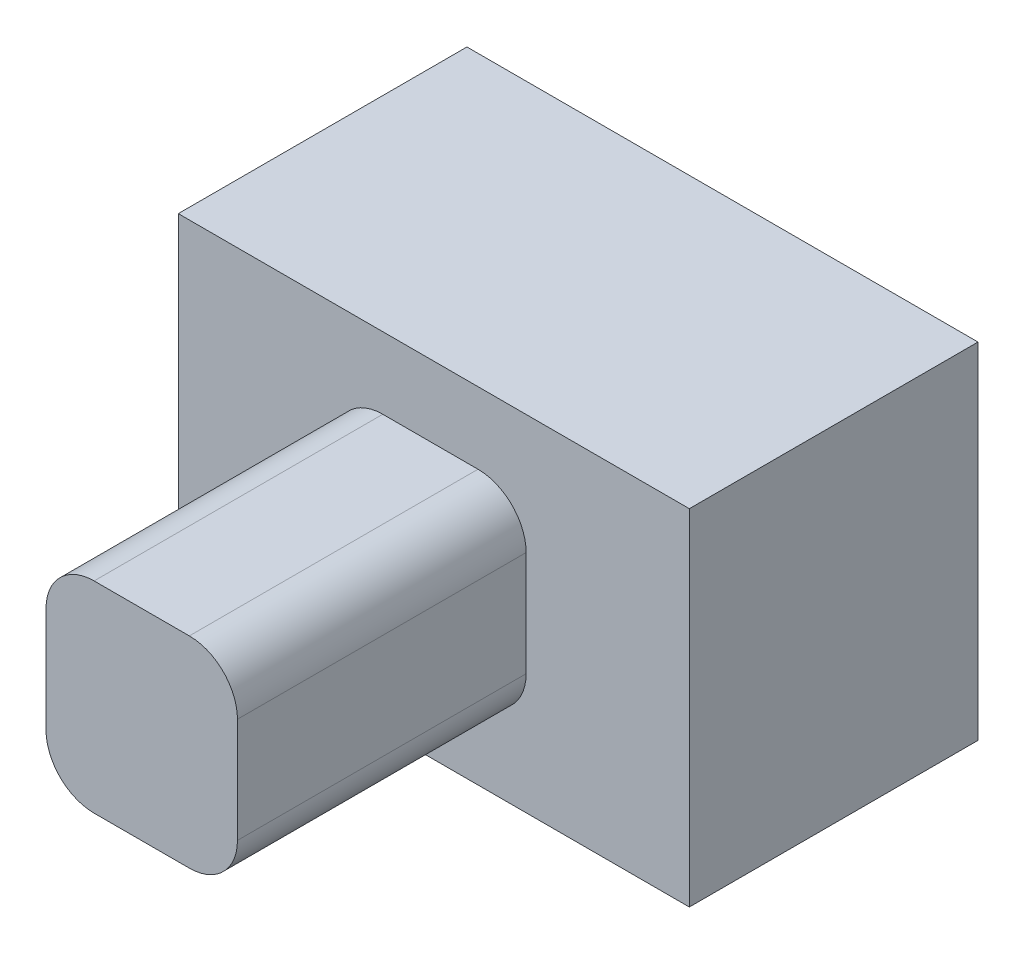
ISO-10303-21;
HEADER;
FILE_DESCRIPTION(('STEP AP214'),'2;1');
FILE_NAME('part.step','',(''),(''),'','','');
FILE_SCHEMA(('AUTOMOTIVE_DESIGN { 1 0 10303 214 1 1 1 1 }'));
ENDSEC;
DATA;
#1=APPLICATION_CONTEXT('core data for automotive mechanical design processes');
#2=APPLICATION_PROTOCOL_DEFINITION('international standard','automotive_design',2000,#1);
#3=PRODUCT_CONTEXT('',#1,'mechanical');
#4=PRODUCT('Part','Part','',(#3));
#5=PRODUCT_RELATED_PRODUCT_CATEGORY('part','',(#4));
#6=PRODUCT_DEFINITION_FORMATION('','',#4);
#7=PRODUCT_DEFINITION_CONTEXT('part definition',#1,'design');
#8=PRODUCT_DEFINITION('design','',#6,#7);
#9=PRODUCT_DEFINITION_SHAPE('','',#8);
#10=(LENGTH_UNIT() NAMED_UNIT(*) SI_UNIT(.MILLI.,.METRE.));
#11=(NAMED_UNIT(*) PLANE_ANGLE_UNIT() SI_UNIT($,.RADIAN.));
#12=(NAMED_UNIT(*) SI_UNIT($,.STERADIAN.) SOLID_ANGLE_UNIT());
#13=UNCERTAINTY_MEASURE_WITH_UNIT(LENGTH_MEASURE(1.E-05),#10,'distance_accuracy_value','');
#14=(GEOMETRIC_REPRESENTATION_CONTEXT(3) GLOBAL_UNCERTAINTY_ASSIGNED_CONTEXT((#13)) GLOBAL_UNIT_ASSIGNED_CONTEXT((#10,
#11,#12)) REPRESENTATION_CONTEXT('',''));
#15=CARTESIAN_POINT('',(0.,0.,0.));
#16=DIRECTION('',(0.,0.,1.));
#17=DIRECTION('',(1.,0.,0.));
#18=AXIS2_PLACEMENT_3D('',#15,#16,#17);
#19=CARTESIAN_POINT('',(-2.41990740449457,4.41492844309721,6.));
#20=DIRECTION('',(1.,0.,0.));
#21=DIRECTION('',(0.,0.,-1.));
#22=AXIS2_PLACEMENT_3D('',#19,#20,#21);
#23=PLANE('',#22);
#24=DIRECTION('',(0.,-1.,0.));
#25=VECTOR('',#24,1.);
#26=CARTESIAN_POINT('',(-2.41990740449457,4.41492844309721,0.));
#27=LINE('',#26,#25);
#28=CARTESIAN_POINT('',(-2.41990740449457,4.41492844309721,0.));
#29=VERTEX_POINT('',#28);
#30=CARTESIAN_POINT('',(-2.41990740449457,-2.75613061858981,0.));
#31=VERTEX_POINT('',#30);
#32=EDGE_CURVE('E245',#29,#31,#27,.T.);
#33=ORIENTED_EDGE('',*,*,#32,.T.);
#34=DIRECTION('',(0.,0.,-1.));
#35=VECTOR('',#34,1.);
#36=CARTESIAN_POINT('',(-2.41990740449457,-2.75613061858981,6.));
#37=LINE('',#36,#35);
#38=CARTESIAN_POINT('',(-2.41990740449457,-2.75613061858981,6.));
#39=VERTEX_POINT('',#38);
#40=EDGE_CURVE('E11',#39,#31,#37,.T.);
#41=ORIENTED_EDGE('',*,*,#40,.F.);
#42=DIRECTION('',(0.,-1.,0.));
#43=VECTOR('',#42,1.);
#44=CARTESIAN_POINT('',(-2.41990740449457,4.41492844309721,6.));
#45=LINE('',#44,#43);
#46=CARTESIAN_POINT('',(-2.41990740449457,4.41492844309721,6.));
#47=VERTEX_POINT('',#46);
#48=EDGE_CURVE('E246',#47,#39,#45,.T.);
#49=ORIENTED_EDGE('',*,*,#48,.F.);
#50=DIRECTION('',(0.,0.,-1.));
#51=VECTOR('',#50,1.);
#52=CARTESIAN_POINT('',(-2.41990740449457,4.41492844309721,6.));
#53=LINE('',#52,#51);
#54=EDGE_CURVE('E256',#47,#29,#53,.T.);
#55=ORIENTED_EDGE('',*,*,#54,.T.);
#56=EDGE_LOOP('',(#33,#41,#49,#55));
#57=FACE_BOUND('',#56,.T.);
#58=ADVANCED_FACE('F33',(#57),#23,.F.);
#59=CARTESIAN_POINT('',(-2.41990740449457,-2.75613061858981,6.));
#60=DIRECTION('',(0.,1.,0.));
#61=DIRECTION('',(0.,0.,1.));
#62=AXIS2_PLACEMENT_3D('',#59,#60,#61);
#63=PLANE('',#62);
#64=DIRECTION('',(1.,0.,0.));
#65=VECTOR('',#64,1.);
#66=CARTESIAN_POINT('',(-2.41990740449457,-2.75613061858981,0.));
#67=LINE('',#66,#65);
#68=CARTESIAN_POINT('',(8.20297188967766,-2.75613061858981,0.));
#69=VERTEX_POINT('',#68);
#70=EDGE_CURVE('E259',#31,#69,#67,.T.);
#71=ORIENTED_EDGE('',*,*,#70,.T.);
#72=DIRECTION('',(0.,0.,-1.));
#73=VECTOR('',#72,1.);
#74=CARTESIAN_POINT('',(8.20297188967766,-2.75613061858981,6.));
#75=LINE('',#74,#73);
#76=CARTESIAN_POINT('',(8.20297188967766,-2.75613061858981,6.));
#77=VERTEX_POINT('',#76);
#78=EDGE_CURVE('E40',#77,#69,#75,.T.);
#79=ORIENTED_EDGE('',*,*,#78,.F.);
#80=DIRECTION('',(1.,0.,0.));
#81=VECTOR('',#80,1.);
#82=CARTESIAN_POINT('',(-2.41990740449457,-2.75613061858981,6.));
#83=LINE('',#82,#81);
#84=EDGE_CURVE('E249',#39,#77,#83,.T.);
#85=ORIENTED_EDGE('',*,*,#84,.F.);
#86=ORIENTED_EDGE('',*,*,#40,.T.);
#87=EDGE_LOOP('',(#71,#79,#85,#86));
#88=FACE_BOUND('',#87,.T.);
#89=ADVANCED_FACE('F289',(#88),#63,.F.);
#90=CARTESIAN_POINT('',(8.20297188967766,4.41492844309721,6.));
#91=DIRECTION('',(-1.,0.,0.));
#92=DIRECTION('',(0.,0.,1.));
#93=AXIS2_PLACEMENT_3D('',#90,#91,#92);
#94=PLANE('',#93);
#95=DIRECTION('',(0.,1.,0.));
#96=VECTOR('',#95,1.);
#97=CARTESIAN_POINT('',(8.20297188967766,4.41492844309721,0.));
#98=LINE('',#97,#96);
#99=CARTESIAN_POINT('',(8.20297188967766,4.41492844309721,0.));
#100=VERTEX_POINT('',#99);
#101=EDGE_CURVE('E261',#69,#100,#98,.T.);
#102=ORIENTED_EDGE('',*,*,#101,.T.);
#103=DIRECTION('',(0.,0.,-1.));
#104=VECTOR('',#103,1.);
#105=CARTESIAN_POINT('',(8.20297188967766,4.41492844309721,6.));
#106=LINE('',#105,#104);
#107=CARTESIAN_POINT('',(8.20297188967766,4.41492844309721,6.));
#108=VERTEX_POINT('',#107);
#109=EDGE_CURVE('E266',#108,#100,#106,.T.);
#110=ORIENTED_EDGE('',*,*,#109,.F.);
#111=DIRECTION('',(0.,1.,0.));
#112=VECTOR('',#111,1.);
#113=CARTESIAN_POINT('',(8.20297188967766,4.41492844309721,6.));
#114=LINE('',#113,#112);
#115=EDGE_CURVE('E252',#77,#108,#114,.T.);
#116=ORIENTED_EDGE('',*,*,#115,.F.);
#117=ORIENTED_EDGE('',*,*,#78,.T.);
#118=EDGE_LOOP('',(#102,#110,#116,#117));
#119=FACE_BOUND('',#118,.T.);
#120=ADVANCED_FACE('F273',(#119),#94,.F.);
#121=CARTESIAN_POINT('',(-2.41990740449457,4.41492844309721,6.));
#122=DIRECTION('',(0.,-1.,0.));
#123=DIRECTION('',(0.,0.,-1.));
#124=AXIS2_PLACEMENT_3D('',#121,#122,#123);
#125=PLANE('',#124);
#126=DIRECTION('',(-1.,0.,0.));
#127=VECTOR('',#126,1.);
#128=CARTESIAN_POINT('',(-2.41990740449457,4.41492844309721,0.));
#129=LINE('',#128,#127);
#130=EDGE_CURVE('E250',#100,#29,#129,.T.);
#131=ORIENTED_EDGE('',*,*,#130,.T.);
#132=ORIENTED_EDGE('',*,*,#54,.F.);
#133=DIRECTION('',(-1.,0.,0.));
#134=VECTOR('',#133,1.);
#135=CARTESIAN_POINT('',(-2.41990740449457,4.41492844309721,6.));
#136=LINE('',#135,#134);
#137=EDGE_CURVE('E254',#108,#47,#136,.T.);
#138=ORIENTED_EDGE('',*,*,#137,.F.);
#139=ORIENTED_EDGE('',*,*,#109,.T.);
#140=EDGE_LOOP('',(#131,#132,#138,#139));
#141=FACE_BOUND('',#140,.T.);
#142=ADVANCED_FACE('F282',(#141),#125,.F.);
#143=CARTESIAN_POINT('',(0.,0.,6.));
#144=DIRECTION('',(0.,0.,1.));
#145=DIRECTION('',(1.,0.,0.));
#146=AXIS2_PLACEMENT_3D('',#143,#144,#145);
#147=PLANE('',#146);
#148=CARTESIAN_POINT('',(3.81000054894556,-0.252824236658512,6.));
#149=DIRECTION('',(0.,0.,1.));
#150=DIRECTION('',(1.,0.,0.));
#151=AXIS2_PLACEMENT_3D('',#148,#149,#150);
#152=CIRCLE('',#151,1.);
#153=CARTESIAN_POINT('',(3.81000054894555,-1.25282423665851,6.));
#154=VERTEX_POINT('',#153);
#155=CARTESIAN_POINT('',(4.81000054894556,-0.252824236658505,6.));
#156=VERTEX_POINT('',#155);
#157=EDGE_CURVE('E55',#154,#156,#152,.T.);
#158=ORIENTED_EDGE('',*,*,#157,.F.);
#159=DIRECTION('',(1.,0.,0.));
#160=VECTOR('',#159,1.);
#161=CARTESIAN_POINT('',(1.83046505701709,-1.25282423665851,6.));
#162=LINE('',#161,#160);
#163=CARTESIAN_POINT('',(1.83046505701709,-1.25282423665851,6.));
#164=VERTEX_POINT('',#163);
#165=EDGE_CURVE('E187',#164,#154,#162,.T.);
#166=ORIENTED_EDGE('',*,*,#165,.F.);
#167=CARTESIAN_POINT('',(1.83046505701708,-0.252824236658512,6.));
#168=DIRECTION('',(0.,0.,1.));
#169=DIRECTION('',(1.,0.,0.));
#170=AXIS2_PLACEMENT_3D('',#167,#168,#169);
#171=CIRCLE('',#170,1.);
#172=CARTESIAN_POINT('',(0.830465057017085,-0.252824236658505,6.));
#173=VERTEX_POINT('',#172);
#174=EDGE_CURVE('E218',#173,#164,#171,.T.);
#175=ORIENTED_EDGE('',*,*,#174,.F.);
#176=DIRECTION('',(0.,-1.,0.));
#177=VECTOR('',#176,1.);
#178=CARTESIAN_POINT('',(0.830465057017085,1.92821033289314,6.));
#179=LINE('',#178,#177);
#180=CARTESIAN_POINT('',(0.830465057017085,1.92821033289314,6.));
#181=VERTEX_POINT('',#180);
#182=EDGE_CURVE('E215',#181,#173,#179,.T.);
#183=ORIENTED_EDGE('',*,*,#182,.F.);
#184=CARTESIAN_POINT('',(1.83046505701708,1.92821033289314,6.));
#185=DIRECTION('',(0.,0.,1.));
#186=DIRECTION('',(1.,0.,0.));
#187=AXIS2_PLACEMENT_3D('',#184,#185,#186);
#188=CIRCLE('',#187,1.);
#189=CARTESIAN_POINT('',(1.83046505701709,2.92821033289314,6.));
#190=VERTEX_POINT('',#189);
#191=EDGE_CURVE('E212',#190,#181,#188,.T.);
#192=ORIENTED_EDGE('',*,*,#191,.F.);
#193=DIRECTION('',(-1.,0.,0.));
#194=VECTOR('',#193,1.);
#195=CARTESIAN_POINT('',(1.83046505701709,2.92821033289314,6.));
#196=LINE('',#195,#194);
#197=CARTESIAN_POINT('',(3.81000054894555,2.92821033289314,6.));
#198=VERTEX_POINT('',#197);
#199=EDGE_CURVE('E209',#198,#190,#196,.T.);
#200=ORIENTED_EDGE('',*,*,#199,.F.);
#201=CARTESIAN_POINT('',(3.81000054894556,1.92821033289314,6.));
#202=DIRECTION('',(0.,0.,1.));
#203=DIRECTION('',(-1.,0.,0.));
#204=AXIS2_PLACEMENT_3D('',#201,#202,#203);
#205=CIRCLE('',#204,1.);
#206=CARTESIAN_POINT('',(4.81000054894556,1.92821033289314,6.));
#207=VERTEX_POINT('',#206);
#208=EDGE_CURVE('E206',#207,#198,#205,.T.);
#209=ORIENTED_EDGE('',*,*,#208,.F.);
#210=DIRECTION('',(0.,1.,0.));
#211=VECTOR('',#210,1.);
#212=CARTESIAN_POINT('',(4.81000054894556,1.92821033289314,6.));
#213=LINE('',#212,#211);
#214=EDGE_CURVE('E203',#156,#207,#213,.T.);
#215=ORIENTED_EDGE('',*,*,#214,.F.);
#216=EDGE_LOOP('',(#158,#166,#175,#183,#192,#200,#209,#215));
#217=FACE_BOUND('',#216,.T.);
#218=ORIENTED_EDGE('',*,*,#48,.T.);
#219=ORIENTED_EDGE('',*,*,#84,.T.);
#220=ORIENTED_EDGE('',*,*,#115,.T.);
#221=ORIENTED_EDGE('',*,*,#137,.T.);
#222=EDGE_LOOP('',(#218,#219,#220,#221));
#223=FACE_BOUND('',#222,.T.);
#224=ADVANCED_FACE('F288',(#217,#223),#147,.T.);
#225=CARTESIAN_POINT('',(0.,0.,0.));
#226=DIRECTION('',(0.,0.,1.));
#227=DIRECTION('',(1.,0.,0.));
#228=AXIS2_PLACEMENT_3D('',#225,#226,#227);
#229=PLANE('',#228);
#230=DIRECTION('',(1.,0.,0.));
#231=VECTOR('',#230,1.);
#232=CARTESIAN_POINT('',(1.86943070713204,1.561146251533,0.));
#233=LINE('',#232,#231);
#234=CARTESIAN_POINT('',(1.86943070713204,1.561146251533,0.));
#235=VERTEX_POINT('',#234);
#236=CARTESIAN_POINT('',(3.61943070713204,1.561146251533,0.));
#237=VERTEX_POINT('',#236);
#238=EDGE_CURVE('E174',#235,#237,#233,.T.);
#239=ORIENTED_EDGE('',*,*,#238,.F.);
#240=DIRECTION('',(0.,1.,0.));
#241=VECTOR('',#240,1.);
#242=CARTESIAN_POINT('',(1.86943070713204,-0.188853748467003,0.));
#243=LINE('',#242,#241);
#244=CARTESIAN_POINT('',(1.86943070713204,-0.188853748467003,0.));
#245=VERTEX_POINT('',#244);
#246=EDGE_CURVE('E47',#245,#235,#243,.T.);
#247=ORIENTED_EDGE('',*,*,#246,.F.);
#248=DIRECTION('',(-1.,0.,0.));
#249=VECTOR('',#248,1.);
#250=CARTESIAN_POINT('',(1.86943070713204,-0.188853748467003,0.));
#251=LINE('',#250,#249);
#252=CARTESIAN_POINT('',(3.61943070713204,-0.188853748467003,0.));
#253=VERTEX_POINT('',#252);
#254=EDGE_CURVE('E165',#253,#245,#251,.T.);
#255=ORIENTED_EDGE('',*,*,#254,.F.);
#256=DIRECTION('',(0.,-1.,0.));
#257=VECTOR('',#256,1.);
#258=CARTESIAN_POINT('',(3.61943070713204,-0.188853748467003,0.));
#259=LINE('',#258,#257);
#260=EDGE_CURVE('E168',#237,#253,#259,.T.);
#261=ORIENTED_EDGE('',*,*,#260,.F.);
#262=EDGE_LOOP('',(#239,#247,#255,#261));
#263=FACE_BOUND('',#262,.T.);
#264=ORIENTED_EDGE('',*,*,#32,.F.);
#265=ORIENTED_EDGE('',*,*,#130,.F.);
#266=ORIENTED_EDGE('',*,*,#101,.F.);
#267=ORIENTED_EDGE('',*,*,#70,.F.);
#268=EDGE_LOOP('',(#264,#265,#266,#267));
#269=FACE_BOUND('',#268,.T.);
#270=ADVANCED_FACE('F279',(#263,#269),#229,.F.);
#271=CARTESIAN_POINT('',(3.81000054894556,-0.252824236658512,12.));
#272=DIRECTION('',(0.,0.,-1.));
#273=DIRECTION('',(-1.,0.,0.));
#274=AXIS2_PLACEMENT_3D('',#271,#272,#273);
#275=CYLINDRICAL_SURFACE('',#274,1.);
#276=ORIENTED_EDGE('',*,*,#157,.T.);
#277=DIRECTION('',(0.,0.,-1.));
#278=VECTOR('',#277,1.);
#279=CARTESIAN_POINT('',(4.81000054894556,-0.252824236658505,12.));
#280=LINE('',#279,#278);
#281=CARTESIAN_POINT('',(4.81000054894556,-0.252824236658505,12.));
#282=VERTEX_POINT('',#281);
#283=EDGE_CURVE('E242',#282,#156,#280,.T.);
#284=ORIENTED_EDGE('',*,*,#283,.F.);
#285=CARTESIAN_POINT('',(3.81000054894556,-0.252824236658512,12.));
#286=DIRECTION('',(0.,0.,1.));
#287=DIRECTION('',(1.,0.,0.));
#288=AXIS2_PLACEMENT_3D('',#285,#286,#287);
#289=CIRCLE('',#288,1.);
#290=CARTESIAN_POINT('',(3.81000054894555,-1.25282423665851,12.));
#291=VERTEX_POINT('',#290);
#292=EDGE_CURVE('E183',#291,#282,#289,.T.);
#293=ORIENTED_EDGE('',*,*,#292,.F.);
#294=DIRECTION('',(0.,0.,-1.));
#295=VECTOR('',#294,1.);
#296=CARTESIAN_POINT('',(3.81000054894555,-1.25282423665851,12.));
#297=LINE('',#296,#295);
#298=EDGE_CURVE('E201',#291,#154,#297,.T.);
#299=ORIENTED_EDGE('',*,*,#298,.T.);
#300=EDGE_LOOP('',(#276,#284,#293,#299));
#301=FACE_BOUND('',#300,.T.);
#302=ADVANCED_FACE('F301',(#301),#275,.T.);
#303=CARTESIAN_POINT('',(4.81000054894556,1.92821033289314,12.));
#304=DIRECTION('',(-1.,0.,0.));
#305=DIRECTION('',(0.,0.,1.));
#306=AXIS2_PLACEMENT_3D('',#303,#304,#305);
#307=PLANE('',#306);
#308=ORIENTED_EDGE('',*,*,#214,.T.);
#309=DIRECTION('',(0.,0.,-1.));
#310=VECTOR('',#309,1.);
#311=CARTESIAN_POINT('',(4.81000054894556,1.92821033289314,12.));
#312=LINE('',#311,#310);
#313=CARTESIAN_POINT('',(4.81000054894556,1.92821033289314,12.));
#314=VERTEX_POINT('',#313);
#315=EDGE_CURVE('E239',#314,#207,#312,.T.);
#316=ORIENTED_EDGE('',*,*,#315,.F.);
#317=DIRECTION('',(0.,1.,0.));
#318=VECTOR('',#317,1.);
#319=CARTESIAN_POINT('',(4.81000054894556,1.92821033289314,12.));
#320=LINE('',#319,#318);
#321=EDGE_CURVE('E186',#282,#314,#320,.T.);
#322=ORIENTED_EDGE('',*,*,#321,.F.);
#323=ORIENTED_EDGE('',*,*,#283,.T.);
#324=EDGE_LOOP('',(#308,#316,#322,#323));
#325=FACE_BOUND('',#324,.T.);
#326=ADVANCED_FACE('F307',(#325),#307,.F.);
#327=CARTESIAN_POINT('',(3.81000054894556,1.92821033289314,12.));
#328=DIRECTION('',(0.,0.,-1.));
#329=DIRECTION('',(-1.,0.,0.));
#330=AXIS2_PLACEMENT_3D('',#327,#328,#329);
#331=CYLINDRICAL_SURFACE('',#330,1.);
#332=ORIENTED_EDGE('',*,*,#208,.T.);
#333=DIRECTION('',(0.,0.,-1.));
#334=VECTOR('',#333,1.);
#335=CARTESIAN_POINT('',(3.81000054894555,2.92821033289314,12.));
#336=LINE('',#335,#334);
#337=CARTESIAN_POINT('',(3.81000054894555,2.92821033289314,12.));
#338=VERTEX_POINT('',#337);
#339=EDGE_CURVE('E236',#338,#198,#336,.T.);
#340=ORIENTED_EDGE('',*,*,#339,.F.);
#341=CARTESIAN_POINT('',(3.81000054894556,1.92821033289314,12.));
#342=DIRECTION('',(0.,0.,1.));
#343=DIRECTION('',(-1.,0.,0.));
#344=AXIS2_PLACEMENT_3D('',#341,#342,#343);
#345=CIRCLE('',#344,1.);
#346=EDGE_CURVE('E189',#314,#338,#345,.T.);
#347=ORIENTED_EDGE('',*,*,#346,.F.);
#348=ORIENTED_EDGE('',*,*,#315,.T.);
#349=EDGE_LOOP('',(#332,#340,#347,#348));
#350=FACE_BOUND('',#349,.T.);
#351=ADVANCED_FACE('F311',(#350),#331,.T.);
#352=CARTESIAN_POINT('',(1.83046505701709,2.92821033289314,12.));
#353=DIRECTION('',(0.,-1.,0.));
#354=DIRECTION('',(0.,0.,-1.));
#355=AXIS2_PLACEMENT_3D('',#352,#353,#354);
#356=PLANE('',#355);
#357=ORIENTED_EDGE('',*,*,#199,.T.);
#358=DIRECTION('',(0.,0.,-1.));
#359=VECTOR('',#358,1.);
#360=CARTESIAN_POINT('',(1.83046505701709,2.92821033289314,12.));
#361=LINE('',#360,#359);
#362=CARTESIAN_POINT('',(1.83046505701709,2.92821033289314,12.));
#363=VERTEX_POINT('',#362);
#364=EDGE_CURVE('E233',#363,#190,#361,.T.);
#365=ORIENTED_EDGE('',*,*,#364,.F.);
#366=DIRECTION('',(-1.,0.,0.));
#367=VECTOR('',#366,1.);
#368=CARTESIAN_POINT('',(1.83046505701709,2.92821033289314,12.));
#369=LINE('',#368,#367);
#370=EDGE_CURVE('E191',#338,#363,#369,.T.);
#371=ORIENTED_EDGE('',*,*,#370,.F.);
#372=ORIENTED_EDGE('',*,*,#339,.T.);
#373=EDGE_LOOP('',(#357,#365,#371,#372));
#374=FACE_BOUND('',#373,.T.);
#375=ADVANCED_FACE('F315',(#374),#356,.F.);
#376=CARTESIAN_POINT('',(1.83046505701708,1.92821033289314,12.));
#377=DIRECTION('',(0.,0.,-1.));
#378=DIRECTION('',(-1.,0.,0.));
#379=AXIS2_PLACEMENT_3D('',#376,#377,#378);
#380=CYLINDRICAL_SURFACE('',#379,1.);
#381=ORIENTED_EDGE('',*,*,#191,.T.);
#382=DIRECTION('',(0.,0.,-1.));
#383=VECTOR('',#382,1.);
#384=CARTESIAN_POINT('',(0.830465057017085,1.92821033289314,12.));
#385=LINE('',#384,#383);
#386=CARTESIAN_POINT('',(0.830465057017085,1.92821033289314,12.));
#387=VERTEX_POINT('',#386);
#388=EDGE_CURVE('E230',#387,#181,#385,.T.);
#389=ORIENTED_EDGE('',*,*,#388,.F.);
#390=CARTESIAN_POINT('',(1.83046505701708,1.92821033289314,12.));
#391=DIRECTION('',(0.,0.,1.));
#392=DIRECTION('',(1.,0.,0.));
#393=AXIS2_PLACEMENT_3D('',#390,#391,#392);
#394=CIRCLE('',#393,1.);
#395=EDGE_CURVE('E193',#363,#387,#394,.T.);
#396=ORIENTED_EDGE('',*,*,#395,.F.);
#397=ORIENTED_EDGE('',*,*,#364,.T.);
#398=EDGE_LOOP('',(#381,#389,#396,#397));
#399=FACE_BOUND('',#398,.T.);
#400=ADVANCED_FACE('F319',(#399),#380,.T.);
#401=CARTESIAN_POINT('',(0.830465057017085,1.92821033289314,12.));
#402=DIRECTION('',(1.,0.,0.));
#403=DIRECTION('',(0.,0.,-1.));
#404=AXIS2_PLACEMENT_3D('',#401,#402,#403);
#405=PLANE('',#404);
#406=ORIENTED_EDGE('',*,*,#182,.T.);
#407=DIRECTION('',(0.,0.,-1.));
#408=VECTOR('',#407,1.);
#409=CARTESIAN_POINT('',(0.830465057017085,-0.252824236658505,12.));
#410=LINE('',#409,#408);
#411=CARTESIAN_POINT('',(0.830465057017085,-0.252824236658505,12.));
#412=VERTEX_POINT('',#411);
#413=EDGE_CURVE('E227',#412,#173,#410,.T.);
#414=ORIENTED_EDGE('',*,*,#413,.F.);
#415=DIRECTION('',(0.,-1.,0.));
#416=VECTOR('',#415,1.);
#417=CARTESIAN_POINT('',(0.830465057017085,1.92821033289314,12.));
#418=LINE('',#417,#416);
#419=EDGE_CURVE('E195',#387,#412,#418,.T.);
#420=ORIENTED_EDGE('',*,*,#419,.F.);
#421=ORIENTED_EDGE('',*,*,#388,.T.);
#422=EDGE_LOOP('',(#406,#414,#420,#421));
#423=FACE_BOUND('',#422,.T.);
#424=ADVANCED_FACE('F323',(#423),#405,.F.);
#425=CARTESIAN_POINT('',(1.83046505701708,-0.252824236658512,12.));
#426=DIRECTION('',(0.,0.,-1.));
#427=DIRECTION('',(-1.,0.,0.));
#428=AXIS2_PLACEMENT_3D('',#425,#426,#427);
#429=CYLINDRICAL_SURFACE('',#428,1.);
#430=ORIENTED_EDGE('',*,*,#174,.T.);
#431=DIRECTION('',(0.,0.,-1.));
#432=VECTOR('',#431,1.);
#433=CARTESIAN_POINT('',(1.83046505701709,-1.25282423665851,12.));
#434=LINE('',#433,#432);
#435=CARTESIAN_POINT('',(1.83046505701709,-1.25282423665851,12.));
#436=VERTEX_POINT('',#435);
#437=EDGE_CURVE('E224',#436,#164,#434,.T.);
#438=ORIENTED_EDGE('',*,*,#437,.F.);
#439=CARTESIAN_POINT('',(1.83046505701708,-0.252824236658512,12.));
#440=DIRECTION('',(0.,0.,1.));
#441=DIRECTION('',(1.,0.,0.));
#442=AXIS2_PLACEMENT_3D('',#439,#440,#441);
#443=CIRCLE('',#442,1.);
#444=EDGE_CURVE('E197',#412,#436,#443,.T.);
#445=ORIENTED_EDGE('',*,*,#444,.F.);
#446=ORIENTED_EDGE('',*,*,#413,.T.);
#447=EDGE_LOOP('',(#430,#438,#445,#446));
#448=FACE_BOUND('',#447,.T.);
#449=ADVANCED_FACE('F327',(#448),#429,.T.);
#450=CARTESIAN_POINT('',(1.83046505701709,-1.25282423665851,12.));
#451=DIRECTION('',(0.,1.,0.));
#452=DIRECTION('',(0.,0.,1.));
#453=AXIS2_PLACEMENT_3D('',#450,#451,#452);
#454=PLANE('',#453);
#455=ORIENTED_EDGE('',*,*,#165,.T.);
#456=ORIENTED_EDGE('',*,*,#298,.F.);
#457=DIRECTION('',(1.,0.,0.));
#458=VECTOR('',#457,1.);
#459=CARTESIAN_POINT('',(1.83046505701709,-1.25282423665851,12.));
#460=LINE('',#459,#458);
#461=EDGE_CURVE('E199',#436,#291,#460,.T.);
#462=ORIENTED_EDGE('',*,*,#461,.F.);
#463=ORIENTED_EDGE('',*,*,#437,.T.);
#464=EDGE_LOOP('',(#455,#456,#462,#463));
#465=FACE_BOUND('',#464,.T.);
#466=ADVANCED_FACE('F331',(#465),#454,.F.);
#467=CARTESIAN_POINT('',(3.81000054894556,-0.252824236658512,12.));
#468=DIRECTION('',(0.,0.,1.));
#469=DIRECTION('',(1.,0.,0.));
#470=AXIS2_PLACEMENT_3D('',#467,#468,#469);
#471=PLANE('',#470);
#472=ORIENTED_EDGE('',*,*,#292,.T.);
#473=ORIENTED_EDGE('',*,*,#321,.T.);
#474=ORIENTED_EDGE('',*,*,#346,.T.);
#475=ORIENTED_EDGE('',*,*,#370,.T.);
#476=ORIENTED_EDGE('',*,*,#395,.T.);
#477=ORIENTED_EDGE('',*,*,#419,.T.);
#478=ORIENTED_EDGE('',*,*,#444,.T.);
#479=ORIENTED_EDGE('',*,*,#461,.T.);
#480=EDGE_LOOP('',(#472,#473,#474,#475,#476,#477,#478,#479));
#481=FACE_BOUND('',#480,.T.);
#482=ADVANCED_FACE('F335',(#481),#471,.T.);
#483=CARTESIAN_POINT('',(1.86943070713204,-0.188853748467003,4.));
#484=DIRECTION('',(-1.,0.,0.));
#485=DIRECTION('',(0.,0.,1.));
#486=AXIS2_PLACEMENT_3D('',#483,#484,#485);
#487=PLANE('',#486);
#488=ORIENTED_EDGE('',*,*,#246,.T.);
#489=DIRECTION('',(0.,0.,-1.));
#490=VECTOR('',#489,1.);
#491=CARTESIAN_POINT('',(1.86943070713204,1.561146251533,4.));
#492=LINE('',#491,#490);
#493=CARTESIAN_POINT('',(1.86943070713204,1.561146251533,4.));
#494=VERTEX_POINT('',#493);
#495=EDGE_CURVE('E143',#494,#235,#492,.T.);
#496=ORIENTED_EDGE('',*,*,#495,.F.);
#497=DIRECTION('',(0.,1.,0.));
#498=VECTOR('',#497,1.);
#499=CARTESIAN_POINT('',(1.86943070713204,-0.188853748467003,4.));
#500=LINE('',#499,#498);
#501=CARTESIAN_POINT('',(1.86943070713204,-0.188853748467003,4.));
#502=VERTEX_POINT('',#501);
#503=EDGE_CURVE('E147',#502,#494,#500,.T.);
#504=ORIENTED_EDGE('',*,*,#503,.F.);
#505=DIRECTION('',(0.,0.,-1.));
#506=VECTOR('',#505,1.);
#507=CARTESIAN_POINT('',(1.86943070713204,-0.188853748467003,4.));
#508=LINE('',#507,#506);
#509=EDGE_CURVE('E178',#502,#245,#508,.T.);
#510=ORIENTED_EDGE('',*,*,#509,.T.);
#511=EDGE_LOOP('',(#488,#496,#504,#510));
#512=FACE_BOUND('',#511,.T.);
#513=ADVANCED_FACE('F145',(#512),#487,.F.);
#514=CARTESIAN_POINT('',(1.86943070713204,-0.188853748467003,4.));
#515=DIRECTION('',(0.,-1.,0.));
#516=DIRECTION('',(1.,0.,0.));
#517=AXIS2_PLACEMENT_3D('',#514,#515,#516);
#518=PLANE('',#517);
#519=ORIENTED_EDGE('',*,*,#254,.T.);
#520=ORIENTED_EDGE('',*,*,#509,.F.);
#521=DIRECTION('',(-1.,0.,0.));
#522=VECTOR('',#521,1.);
#523=CARTESIAN_POINT('',(1.86943070713204,-0.188853748467003,4.));
#524=LINE('',#523,#522);
#525=CARTESIAN_POINT('',(3.61943070713204,-0.188853748467003,4.));
#526=VERTEX_POINT('',#525);
#527=EDGE_CURVE('E153',#526,#502,#524,.T.);
#528=ORIENTED_EDGE('',*,*,#527,.F.);
#529=DIRECTION('',(0.,0.,-1.));
#530=VECTOR('',#529,1.);
#531=CARTESIAN_POINT('',(3.61943070713204,-0.188853748467003,4.));
#532=LINE('',#531,#530);
#533=EDGE_CURVE('E180',#526,#253,#532,.T.);
#534=ORIENTED_EDGE('',*,*,#533,.T.);
#535=EDGE_LOOP('',(#519,#520,#528,#534));
#536=FACE_BOUND('',#535,.T.);
#537=ADVANCED_FACE('F342',(#536),#518,.F.);
#538=CARTESIAN_POINT('',(3.61943070713204,-0.188853748467003,4.));
#539=DIRECTION('',(1.,0.,0.));
#540=DIRECTION('',(0.,1.,0.));
#541=AXIS2_PLACEMENT_3D('',#538,#539,#540);
#542=PLANE('',#541);
#543=ORIENTED_EDGE('',*,*,#260,.T.);
#544=ORIENTED_EDGE('',*,*,#533,.F.);
#545=DIRECTION('',(0.,-1.,0.));
#546=VECTOR('',#545,1.);
#547=CARTESIAN_POINT('',(3.61943070713204,-0.188853748467003,4.));
#548=LINE('',#547,#546);
#549=CARTESIAN_POINT('',(3.61943070713204,1.561146251533,4.));
#550=VERTEX_POINT('',#549);
#551=EDGE_CURVE('E161',#550,#526,#548,.T.);
#552=ORIENTED_EDGE('',*,*,#551,.F.);
#553=DIRECTION('',(0.,0.,-1.));
#554=VECTOR('',#553,1.);
#555=CARTESIAN_POINT('',(3.61943070713204,1.561146251533,4.));
#556=LINE('',#555,#554);
#557=EDGE_CURVE('E152',#550,#237,#556,.T.);
#558=ORIENTED_EDGE('',*,*,#557,.T.);
#559=EDGE_LOOP('',(#543,#544,#552,#558));
#560=FACE_BOUND('',#559,.T.);
#561=ADVANCED_FACE('F345',(#560),#542,.F.);
#562=CARTESIAN_POINT('',(1.86943070713204,1.561146251533,4.));
#563=DIRECTION('',(0.,1.,0.));
#564=DIRECTION('',(0.,0.,1.));
#565=AXIS2_PLACEMENT_3D('',#562,#563,#564);
#566=PLANE('',#565);
#567=ORIENTED_EDGE('',*,*,#238,.T.);
#568=ORIENTED_EDGE('',*,*,#557,.F.);
#569=DIRECTION('',(1.,0.,0.));
#570=VECTOR('',#569,1.);
#571=CARTESIAN_POINT('',(1.86943070713204,1.561146251533,4.));
#572=LINE('',#571,#570);
#573=EDGE_CURVE('E156',#494,#550,#572,.T.);
#574=ORIENTED_EDGE('',*,*,#573,.F.);
#575=ORIENTED_EDGE('',*,*,#495,.T.);
#576=EDGE_LOOP('',(#567,#568,#574,#575));
#577=FACE_BOUND('',#576,.T.);
#578=ADVANCED_FACE('F157',(#577),#566,.F.);
#579=CARTESIAN_POINT('',(0.,0.,4.));
#580=DIRECTION('',(0.,0.,-1.));
#581=DIRECTION('',(-1.,0.,0.));
#582=AXIS2_PLACEMENT_3D('',#579,#580,#581);
#583=PLANE('',#582);
#584=ORIENTED_EDGE('',*,*,#503,.T.);
#585=ORIENTED_EDGE('',*,*,#573,.T.);
#586=ORIENTED_EDGE('',*,*,#551,.T.);
#587=ORIENTED_EDGE('',*,*,#527,.T.);
#588=EDGE_LOOP('',(#584,#585,#586,#587));
#589=FACE_BOUND('',#588,.T.);
#590=ADVANCED_FACE('F163',(#589),#583,.T.);
#591=CLOSED_SHELL('',(#58,#89,#120,#142,#224,#270,#302,#326,#351,#375,#400,#424,#449,#466,#482,
#513,#537,#561,#578,#590));
#592=MANIFOLD_SOLID_BREP('B2',#591);
#593=ADVANCED_BREP_SHAPE_REPRESENTATION('',(#18,#592),#14);
#594=SHAPE_DEFINITION_REPRESENTATION(#9,#593);
ENDSEC;
END-ISO-10303-21;
